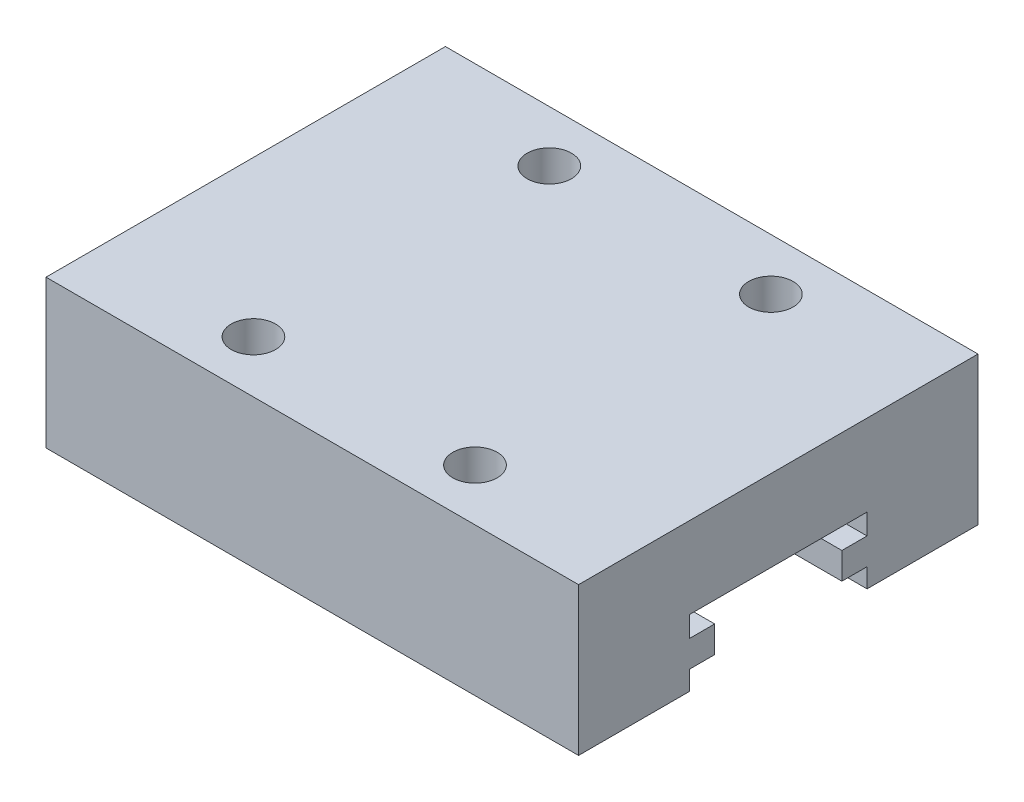
ISO-10303-21;
HEADER;
FILE_DESCRIPTION(('STEP AP214'),'2;1');
FILE_NAME('part.step','',(''),(''),'','','');
FILE_SCHEMA(('AUTOMOTIVE_DESIGN { 1 0 10303 214 1 1 1 1 }'));
ENDSEC;
DATA;
#1=APPLICATION_CONTEXT('core data for automotive mechanical design processes');
#2=APPLICATION_PROTOCOL_DEFINITION('international standard','automotive_design',2000,#1);
#3=PRODUCT_CONTEXT('',#1,'mechanical');
#4=PRODUCT('Part','Part','',(#3));
#5=PRODUCT_RELATED_PRODUCT_CATEGORY('part','',(#4));
#6=PRODUCT_DEFINITION_FORMATION('','',#4);
#7=PRODUCT_DEFINITION_CONTEXT('part definition',#1,'design');
#8=PRODUCT_DEFINITION('design','',#6,#7);
#9=PRODUCT_DEFINITION_SHAPE('','',#8);
#10=(LENGTH_UNIT() NAMED_UNIT(*) SI_UNIT(.MILLI.,.METRE.));
#11=(NAMED_UNIT(*) PLANE_ANGLE_UNIT() SI_UNIT($,.RADIAN.));
#12=(NAMED_UNIT(*) SI_UNIT($,.STERADIAN.) SOLID_ANGLE_UNIT());
#13=UNCERTAINTY_MEASURE_WITH_UNIT(LENGTH_MEASURE(1.E-05),#10,'distance_accuracy_value','');
#14=(GEOMETRIC_REPRESENTATION_CONTEXT(3) GLOBAL_UNCERTAINTY_ASSIGNED_CONTEXT((#13)) GLOBAL_UNIT_ASSIGNED_CONTEXT((#10,
#11,#12)) REPRESENTATION_CONTEXT('',''));
#15=CARTESIAN_POINT('',(0.,0.,0.));
#16=DIRECTION('',(0.,0.,1.));
#17=DIRECTION('',(1.,0.,0.));
#18=AXIS2_PLACEMENT_3D('',#15,#16,#17);
#19=CARTESIAN_POINT('',(0.,0.,0.));
#20=DIRECTION('',(0.,-1.,0.));
#21=DIRECTION('',(0.,0.,-1.));
#22=AXIS2_PLACEMENT_3D('',#19,#20,#21);
#23=PLANE('',#22);
#24=DIRECTION('',(1.,0.,0.));
#25=VECTOR('',#24,1.);
#26=CARTESIAN_POINT('',(-12.8160056179763,0.,-7.5));
#27=LINE('',#26,#25);
#28=CARTESIAN_POINT('',(0.,0.,-7.5));
#29=VERTEX_POINT('',#28);
#30=CARTESIAN_POINT('',(36.,0.,-7.5));
#31=VERTEX_POINT('',#30);
#32=EDGE_CURVE('E183',#29,#31,#27,.T.);
#33=ORIENTED_EDGE('',*,*,#32,.T.);
#34=DIRECTION('',(0.,0.,-1.));
#35=VECTOR('',#34,1.);
#36=CARTESIAN_POINT('',(36.,0.,0.));
#37=LINE('',#36,#35);
#38=CARTESIAN_POINT('',(36.,0.,0.));
#39=VERTEX_POINT('',#38);
#40=EDGE_CURVE('E198',#39,#31,#37,.T.);
#41=ORIENTED_EDGE('',*,*,#40,.F.);
#42=DIRECTION('',(1.,0.,0.));
#43=VECTOR('',#42,1.);
#44=CARTESIAN_POINT('',(0.,0.,0.));
#45=LINE('',#44,#43);
#46=CARTESIAN_POINT('',(0.,0.,0.));
#47=VERTEX_POINT('',#46);
#48=EDGE_CURVE('E214',#47,#39,#45,.T.);
#49=ORIENTED_EDGE('',*,*,#48,.F.);
#50=DIRECTION('',(0.,0.,1.));
#51=VECTOR('',#50,1.);
#52=CARTESIAN_POINT('',(0.,0.,0.));
#53=LINE('',#52,#51);
#54=EDGE_CURVE('E199',#29,#47,#53,.T.);
#55=ORIENTED_EDGE('',*,*,#54,.F.);
#56=EDGE_LOOP('',(#33,#41,#49,#55));
#57=FACE_BOUND('',#56,.T.);
#58=ADVANCED_FACE('F40',(#57),#23,.T.);
#59=CARTESIAN_POINT('',(0.,10.,0.));
#60=DIRECTION('',(1.,0.,0.));
#61=DIRECTION('',(0.,0.,-1.));
#62=AXIS2_PLACEMENT_3D('',#59,#60,#61);
#63=PLANE('',#62);
#64=DIRECTION('',(0.,0.,-1.));
#65=VECTOR('',#64,1.);
#66=CARTESIAN_POINT('',(0.,1.3,-7.5));
#67=LINE('',#66,#65);
#68=CARTESIAN_POINT('',(0.,1.3,-7.5));
#69=VERTEX_POINT('',#68);
#70=CARTESIAN_POINT('',(0.,1.3,-9.2));
#71=VERTEX_POINT('',#70);
#72=EDGE_CURVE('E331',#69,#71,#67,.T.);
#73=ORIENTED_EDGE('',*,*,#72,.F.);
#74=DIRECTION('',(0.,1.,0.));
#75=VECTOR('',#74,1.);
#76=CARTESIAN_POINT('',(0.,0.,-7.5));
#77=LINE('',#76,#75);
#78=EDGE_CURVE('E269',#29,#69,#77,.T.);
#79=ORIENTED_EDGE('',*,*,#78,.F.);
#80=ORIENTED_EDGE('',*,*,#54,.T.);
#81=DIRECTION('',(0.,-1.,0.));
#82=VECTOR('',#81,1.);
#83=CARTESIAN_POINT('',(0.,10.,0.));
#84=LINE('',#83,#82);
#85=CARTESIAN_POINT('',(0.,10.,0.));
#86=VERTEX_POINT('',#85);
#87=EDGE_CURVE('E11',#86,#47,#84,.T.);
#88=ORIENTED_EDGE('',*,*,#87,.F.);
#89=DIRECTION('',(0.,0.,1.));
#90=VECTOR('',#89,1.);
#91=CARTESIAN_POINT('',(0.,10.,0.));
#92=LINE('',#91,#90);
#93=CARTESIAN_POINT('',(0.,10.,-27.));
#94=VERTEX_POINT('',#93);
#95=EDGE_CURVE('E212',#94,#86,#92,.T.);
#96=ORIENTED_EDGE('',*,*,#95,.F.);
#97=DIRECTION('',(0.,-1.,0.));
#98=VECTOR('',#97,1.);
#99=CARTESIAN_POINT('',(0.,10.,-27.));
#100=LINE('',#99,#98);
#101=CARTESIAN_POINT('',(0.,0.,-27.));
#102=VERTEX_POINT('',#101);
#103=EDGE_CURVE('E218',#94,#102,#100,.T.);
#104=ORIENTED_EDGE('',*,*,#103,.T.);
#105=CARTESIAN_POINT('',(0.,0.,-19.5));
#106=VERTEX_POINT('',#105);
#107=EDGE_CURVE('E229',#102,#106,#53,.T.);
#108=ORIENTED_EDGE('',*,*,#107,.T.);
#109=DIRECTION('',(0.,-1.,0.));
#110=VECTOR('',#109,1.);
#111=CARTESIAN_POINT('',(0.,0.,-19.5));
#112=LINE('',#111,#110);
#113=CARTESIAN_POINT('',(0.,1.3,-19.5));
#114=VERTEX_POINT('',#113);
#115=EDGE_CURVE('E59',#114,#106,#112,.T.);
#116=ORIENTED_EDGE('',*,*,#115,.F.);
#117=DIRECTION('',(0.,0.,-1.));
#118=VECTOR('',#117,1.);
#119=CARTESIAN_POINT('',(0.,1.3,-19.5));
#120=LINE('',#119,#118);
#121=CARTESIAN_POINT('',(0.,1.3,-17.8));
#122=VERTEX_POINT('',#121);
#123=EDGE_CURVE('E355',#122,#114,#120,.T.);
#124=ORIENTED_EDGE('',*,*,#123,.F.);
#125=DIRECTION('',(0.,-1.,0.));
#126=VECTOR('',#125,1.);
#127=CARTESIAN_POINT('',(0.,3.1,-17.8));
#128=LINE('',#127,#126);
#129=CARTESIAN_POINT('',(0.,3.1,-17.8));
#130=VERTEX_POINT('',#129);
#131=EDGE_CURVE('E352',#130,#122,#128,.T.);
#132=ORIENTED_EDGE('',*,*,#131,.F.);
#133=DIRECTION('',(0.,0.,1.));
#134=VECTOR('',#133,1.);
#135=CARTESIAN_POINT('',(0.,3.1,-19.5));
#136=LINE('',#135,#134);
#137=CARTESIAN_POINT('',(0.,3.1,-19.5));
#138=VERTEX_POINT('',#137);
#139=EDGE_CURVE('E349',#138,#130,#136,.T.);
#140=ORIENTED_EDGE('',*,*,#139,.F.);
#141=DIRECTION('',(0.,-1.,0.));
#142=VECTOR('',#141,1.);
#143=CARTESIAN_POINT('',(0.,3.1,-19.5));
#144=LINE('',#143,#142);
#145=CARTESIAN_POINT('',(0.,4.5,-19.5));
#146=VERTEX_POINT('',#145);
#147=EDGE_CURVE('E346',#146,#138,#144,.T.);
#148=ORIENTED_EDGE('',*,*,#147,.F.);
#149=DIRECTION('',(0.,0.,-1.));
#150=VECTOR('',#149,1.);
#151=CARTESIAN_POINT('',(0.,4.5,-7.5));
#152=LINE('',#151,#150);
#153=CARTESIAN_POINT('',(0.,4.5,-7.5));
#154=VERTEX_POINT('',#153);
#155=EDGE_CURVE('E343',#154,#146,#152,.T.);
#156=ORIENTED_EDGE('',*,*,#155,.F.);
#157=DIRECTION('',(0.,1.,0.));
#158=VECTOR('',#157,1.);
#159=CARTESIAN_POINT('',(0.,3.1,-7.5));
#160=LINE('',#159,#158);
#161=CARTESIAN_POINT('',(0.,3.1,-7.5));
#162=VERTEX_POINT('',#161);
#163=EDGE_CURVE('E340',#162,#154,#160,.T.);
#164=ORIENTED_EDGE('',*,*,#163,.F.);
#165=DIRECTION('',(0.,0.,1.));
#166=VECTOR('',#165,1.);
#167=CARTESIAN_POINT('',(0.,3.1,-7.5));
#168=LINE('',#167,#166);
#169=CARTESIAN_POINT('',(0.,3.1,-9.2));
#170=VERTEX_POINT('',#169);
#171=EDGE_CURVE('E337',#170,#162,#168,.T.);
#172=ORIENTED_EDGE('',*,*,#171,.F.);
#173=DIRECTION('',(0.,1.,0.));
#174=VECTOR('',#173,1.);
#175=CARTESIAN_POINT('',(0.,3.1,-9.2));
#176=LINE('',#175,#174);
#177=EDGE_CURVE('E334',#71,#170,#176,.T.);
#178=ORIENTED_EDGE('',*,*,#177,.F.);
#179=EDGE_LOOP('',(#73,#79,#80,#88,#96,#104,#108,#116,#124,#132,#140,#148,#156,#164,#172,#178));
#180=FACE_BOUND('',#179,.T.);
#181=ADVANCED_FACE('F42',(#180),#63,.F.);
#182=CARTESIAN_POINT('',(0.,10.,0.));
#183=DIRECTION('',(0.,0.,-1.));
#184=DIRECTION('',(-1.,0.,0.));
#185=AXIS2_PLACEMENT_3D('',#182,#183,#184);
#186=PLANE('',#185);
#187=ORIENTED_EDGE('',*,*,#48,.T.);
#188=DIRECTION('',(0.,-1.,0.));
#189=VECTOR('',#188,1.);
#190=CARTESIAN_POINT('',(36.,10.,0.));
#191=LINE('',#190,#189);
#192=CARTESIAN_POINT('',(36.,10.,0.));
#193=VERTEX_POINT('',#192);
#194=EDGE_CURVE('E49',#193,#39,#191,.T.);
#195=ORIENTED_EDGE('',*,*,#194,.F.);
#196=DIRECTION('',(1.,0.,0.));
#197=VECTOR('',#196,1.);
#198=CARTESIAN_POINT('',(0.,10.,0.));
#199=LINE('',#198,#197);
#200=EDGE_CURVE('E104',#86,#193,#199,.T.);
#201=ORIENTED_EDGE('',*,*,#200,.F.);
#202=ORIENTED_EDGE('',*,*,#87,.T.);
#203=EDGE_LOOP('',(#187,#195,#201,#202));
#204=FACE_BOUND('',#203,.T.);
#205=ADVANCED_FACE('F370',(#204),#186,.F.);
#206=CARTESIAN_POINT('',(36.,10.,0.));
#207=DIRECTION('',(-1.,0.,0.));
#208=DIRECTION('',(0.,0.,1.));
#209=AXIS2_PLACEMENT_3D('',#206,#207,#208);
#210=PLANE('',#209);
#211=ORIENTED_EDGE('',*,*,#40,.T.);
#212=DIRECTION('',(0.,-1.,0.));
#213=VECTOR('',#212,1.);
#214=CARTESIAN_POINT('',(36.,0.,-7.5));
#215=LINE('',#214,#213);
#216=CARTESIAN_POINT('',(36.,1.3,-7.5));
#217=VERTEX_POINT('',#216);
#218=EDGE_CURVE('E180',#217,#31,#215,.T.);
#219=ORIENTED_EDGE('',*,*,#218,.F.);
#220=DIRECTION('',(0.,0.,1.));
#221=VECTOR('',#220,1.);
#222=CARTESIAN_POINT('',(36.,1.3,-7.5));
#223=LINE('',#222,#221);
#224=CARTESIAN_POINT('',(36.,1.3,-9.2));
#225=VERTEX_POINT('',#224);
#226=EDGE_CURVE('E202',#225,#217,#223,.T.);
#227=ORIENTED_EDGE('',*,*,#226,.F.);
#228=DIRECTION('',(0.,-1.,0.));
#229=VECTOR('',#228,1.);
#230=CARTESIAN_POINT('',(36.,3.1,-9.2));
#231=LINE('',#230,#229);
#232=CARTESIAN_POINT('',(36.,3.1,-9.2));
#233=VERTEX_POINT('',#232);
#234=EDGE_CURVE('E303',#233,#225,#231,.T.);
#235=ORIENTED_EDGE('',*,*,#234,.F.);
#236=DIRECTION('',(0.,0.,-1.));
#237=VECTOR('',#236,1.);
#238=CARTESIAN_POINT('',(36.,3.1,-7.5));
#239=LINE('',#238,#237);
#240=CARTESIAN_POINT('',(36.,3.1,-7.5));
#241=VERTEX_POINT('',#240);
#242=EDGE_CURVE('E306',#241,#233,#239,.T.);
#243=ORIENTED_EDGE('',*,*,#242,.F.);
#244=DIRECTION('',(0.,-1.,0.));
#245=VECTOR('',#244,1.);
#246=CARTESIAN_POINT('',(36.,3.1,-7.5));
#247=LINE('',#246,#245);
#248=CARTESIAN_POINT('',(36.,4.5,-7.5));
#249=VERTEX_POINT('',#248);
#250=EDGE_CURVE('E309',#249,#241,#247,.T.);
#251=ORIENTED_EDGE('',*,*,#250,.F.);
#252=DIRECTION('',(0.,0.,1.));
#253=VECTOR('',#252,1.);
#254=CARTESIAN_POINT('',(36.,4.5,-7.5));
#255=LINE('',#254,#253);
#256=CARTESIAN_POINT('',(36.,4.5,-19.5));
#257=VERTEX_POINT('',#256);
#258=EDGE_CURVE('E312',#257,#249,#255,.T.);
#259=ORIENTED_EDGE('',*,*,#258,.F.);
#260=DIRECTION('',(0.,1.,0.));
#261=VECTOR('',#260,1.);
#262=CARTESIAN_POINT('',(36.,3.1,-19.5));
#263=LINE('',#262,#261);
#264=CARTESIAN_POINT('',(36.,3.1,-19.5));
#265=VERTEX_POINT('',#264);
#266=EDGE_CURVE('E315',#265,#257,#263,.T.);
#267=ORIENTED_EDGE('',*,*,#266,.F.);
#268=DIRECTION('',(0.,0.,-1.));
#269=VECTOR('',#268,1.);
#270=CARTESIAN_POINT('',(36.,3.1,-19.5));
#271=LINE('',#270,#269);
#272=CARTESIAN_POINT('',(36.,3.1,-17.8));
#273=VERTEX_POINT('',#272);
#274=EDGE_CURVE('E318',#273,#265,#271,.T.);
#275=ORIENTED_EDGE('',*,*,#274,.F.);
#276=DIRECTION('',(0.,1.,0.));
#277=VECTOR('',#276,1.);
#278=CARTESIAN_POINT('',(36.,3.1,-17.8));
#279=LINE('',#278,#277);
#280=CARTESIAN_POINT('',(36.,1.3,-17.8));
#281=VERTEX_POINT('',#280);
#282=EDGE_CURVE('E321',#281,#273,#279,.T.);
#283=ORIENTED_EDGE('',*,*,#282,.F.);
#284=DIRECTION('',(0.,0.,1.));
#285=VECTOR('',#284,1.);
#286=CARTESIAN_POINT('',(36.,1.3,-19.5));
#287=LINE('',#286,#285);
#288=CARTESIAN_POINT('',(36.,1.3,-19.5));
#289=VERTEX_POINT('',#288);
#290=EDGE_CURVE('E324',#289,#281,#287,.T.);
#291=ORIENTED_EDGE('',*,*,#290,.F.);
#292=DIRECTION('',(0.,1.,0.));
#293=VECTOR('',#292,1.);
#294=CARTESIAN_POINT('',(36.,0.,-19.5));
#295=LINE('',#294,#293);
#296=CARTESIAN_POINT('',(36.,0.,-19.5));
#297=VERTEX_POINT('',#296);
#298=EDGE_CURVE('E192',#297,#289,#295,.T.);
#299=ORIENTED_EDGE('',*,*,#298,.F.);
#300=CARTESIAN_POINT('',(36.,0.,-27.));
#301=VERTEX_POINT('',#300);
#302=EDGE_CURVE('E208',#297,#301,#37,.T.);
#303=ORIENTED_EDGE('',*,*,#302,.T.);
#304=DIRECTION('',(0.,-1.,0.));
#305=VECTOR('',#304,1.);
#306=CARTESIAN_POINT('',(36.,10.,-27.));
#307=LINE('',#306,#305);
#308=CARTESIAN_POINT('',(36.,10.,-27.));
#309=VERTEX_POINT('',#308);
#310=EDGE_CURVE('E221',#309,#301,#307,.T.);
#311=ORIENTED_EDGE('',*,*,#310,.F.);
#312=DIRECTION('',(0.,0.,-1.));
#313=VECTOR('',#312,1.);
#314=CARTESIAN_POINT('',(36.,10.,0.));
#315=LINE('',#314,#313);
#316=EDGE_CURVE('E238',#193,#309,#315,.T.);
#317=ORIENTED_EDGE('',*,*,#316,.F.);
#318=ORIENTED_EDGE('',*,*,#194,.T.);
#319=EDGE_LOOP('',(#211,#219,#227,#235,#243,#251,#259,#267,#275,#283,#291,#299,#303,#311,#317,#318));
#320=FACE_BOUND('',#319,.T.);
#321=ADVANCED_FACE('F205',(#320),#210,.F.);
#322=CARTESIAN_POINT('',(0.,10.,-27.));
#323=DIRECTION('',(0.,0.,1.));
#324=DIRECTION('',(1.,0.,0.));
#325=AXIS2_PLACEMENT_3D('',#322,#323,#324);
#326=PLANE('',#325);
#327=DIRECTION('',(-1.,0.,0.));
#328=VECTOR('',#327,1.);
#329=CARTESIAN_POINT('',(0.,0.,-27.));
#330=LINE('',#329,#328);
#331=EDGE_CURVE('E94',#301,#102,#330,.T.);
#332=ORIENTED_EDGE('',*,*,#331,.T.);
#333=ORIENTED_EDGE('',*,*,#103,.F.);
#334=DIRECTION('',(-1.,0.,0.));
#335=VECTOR('',#334,1.);
#336=CARTESIAN_POINT('',(0.,10.,-27.));
#337=LINE('',#336,#335);
#338=EDGE_CURVE('E71',#309,#94,#337,.T.);
#339=ORIENTED_EDGE('',*,*,#338,.F.);
#340=ORIENTED_EDGE('',*,*,#310,.T.);
#341=EDGE_LOOP('',(#332,#333,#339,#340));
#342=FACE_BOUND('',#341,.T.);
#343=ADVANCED_FACE('F223',(#342),#326,.F.);
#344=CARTESIAN_POINT('',(0.,10.,0.));
#345=DIRECTION('',(0.,-1.,0.));
#346=DIRECTION('',(0.,0.,-1.));
#347=AXIS2_PLACEMENT_3D('',#344,#345,#346);
#348=PLANE('',#347);
#349=CARTESIAN_POINT('',(25.4999864669187,10.,-23.5));
#350=DIRECTION('',(0.,1.,0.));
#351=DIRECTION('',(0.,0.,1.));
#352=AXIS2_PLACEMENT_3D('',#349,#350,#351);
#353=CIRCLE('',#352,1.5);
#354=CARTESIAN_POINT('',(25.4999864669187,10.,-22.));
#355=VERTEX_POINT('',#354);
#356=EDGE_CURVE('E261',#355,#355,#353,.T.);
#357=ORIENTED_EDGE('',*,*,#356,.F.);
#358=EDGE_LOOP('',(#357));
#359=FACE_BOUND('',#358,.T.);
#360=CARTESIAN_POINT('',(10.5,10.,-3.52014924954561));
#361=DIRECTION('',(0.,1.,0.));
#362=DIRECTION('',(0.,0.,1.));
#363=AXIS2_PLACEMENT_3D('',#360,#361,#362);
#364=CIRCLE('',#363,1.5);
#365=CARTESIAN_POINT('',(10.5,10.,-2.02014924954561));
#366=VERTEX_POINT('',#365);
#367=EDGE_CURVE('E252',#366,#366,#364,.T.);
#368=ORIENTED_EDGE('',*,*,#367,.F.);
#369=EDGE_LOOP('',(#368));
#370=FACE_BOUND('',#369,.T.);
#371=CARTESIAN_POINT('',(25.4999864669187,10.,-3.5));
#372=DIRECTION('',(0.,1.,0.));
#373=DIRECTION('',(0.,0.,1.));
#374=AXIS2_PLACEMENT_3D('',#371,#372,#373);
#375=CIRCLE('',#374,1.5);
#376=CARTESIAN_POINT('',(25.4999864669187,10.,-2.));
#377=VERTEX_POINT('',#376);
#378=EDGE_CURVE('E266',#377,#377,#375,.T.);
#379=ORIENTED_EDGE('',*,*,#378,.F.);
#380=EDGE_LOOP('',(#379));
#381=FACE_BOUND('',#380,.T.);
#382=CARTESIAN_POINT('',(10.5,10.,-23.5201492495456));
#383=DIRECTION('',(0.,1.,0.));
#384=DIRECTION('',(0.,0.,1.));
#385=AXIS2_PLACEMENT_3D('',#382,#383,#384);
#386=CIRCLE('',#385,1.5);
#387=CARTESIAN_POINT('',(10.5,10.,-22.0201492495456));
#388=VERTEX_POINT('',#387);
#389=EDGE_CURVE('E244',#388,#388,#386,.T.);
#390=ORIENTED_EDGE('',*,*,#389,.F.);
#391=EDGE_LOOP('',(#390));
#392=FACE_BOUND('',#391,.T.);
#393=ORIENTED_EDGE('',*,*,#95,.T.);
#394=ORIENTED_EDGE('',*,*,#200,.T.);
#395=ORIENTED_EDGE('',*,*,#316,.T.);
#396=ORIENTED_EDGE('',*,*,#338,.T.);
#397=EDGE_LOOP('',(#393,#394,#395,#396));
#398=FACE_BOUND('',#397,.T.);
#399=ADVANCED_FACE('F382',(#359,#370,#381,#392,#398),#348,.F.);
#400=DIRECTION('',(1.,0.,0.));
#401=VECTOR('',#400,1.);
#402=CARTESIAN_POINT('',(-12.8160056179763,0.,-19.5));
#403=LINE('',#402,#401);
#404=EDGE_CURVE('E201',#106,#297,#403,.T.);
#405=ORIENTED_EDGE('',*,*,#404,.F.);
#406=ORIENTED_EDGE('',*,*,#107,.F.);
#407=ORIENTED_EDGE('',*,*,#331,.F.);
#408=ORIENTED_EDGE('',*,*,#302,.F.);
#409=EDGE_LOOP('',(#405,#406,#407,#408));
#410=FACE_BOUND('',#409,.T.);
#411=ADVANCED_FACE('F227',(#410),#23,.T.);
#412=CARTESIAN_POINT('',(10.5,5.,-23.5201492495456));
#413=DIRECTION('',(0.,1.,0.));
#414=DIRECTION('',(0.,0.,1.));
#415=AXIS2_PLACEMENT_3D('',#412,#413,#414);
#416=CYLINDRICAL_SURFACE('',#415,1.5);
#417=CARTESIAN_POINT('',(10.5,5.,-23.5201492495456));
#418=DIRECTION('',(0.,1.,0.));
#419=DIRECTION('',(0.,0.,1.));
#420=AXIS2_PLACEMENT_3D('',#417,#418,#419);
#421=CIRCLE('',#420,1.5);
#422=CARTESIAN_POINT('',(10.5,5.,-22.0201492495456));
#423=VERTEX_POINT('',#422);
#424=EDGE_CURVE('E234',#423,#423,#421,.T.);
#425=ORIENTED_EDGE('',*,*,#424,.F.);
#426=EDGE_LOOP('',(#425));
#427=FACE_BOUND('',#426,.T.);
#428=ORIENTED_EDGE('',*,*,#389,.T.);
#429=EDGE_LOOP('',(#428));
#430=FACE_BOUND('',#429,.T.);
#431=ADVANCED_FACE('F381',(#427,#430),#416,.F.);
#432=CARTESIAN_POINT('',(10.5,5.,-23.5201492495456));
#433=DIRECTION('',(0.,1.,0.));
#434=DIRECTION('',(0.,0.,1.));
#435=AXIS2_PLACEMENT_3D('',#432,#433,#434);
#436=PLANE('',#435);
#437=ORIENTED_EDGE('',*,*,#424,.T.);
#438=EDGE_LOOP('',(#437));
#439=FACE_BOUND('',#438,.T.);
#440=ADVANCED_FACE('F387',(#439),#436,.T.);
#441=CARTESIAN_POINT('',(25.4999864669187,5.,-3.5));
#442=DIRECTION('',(0.,1.,0.));
#443=DIRECTION('',(0.,0.,1.));
#444=AXIS2_PLACEMENT_3D('',#441,#442,#443);
#445=CYLINDRICAL_SURFACE('',#444,1.5);
#446=CARTESIAN_POINT('',(25.4999864669187,5.,-3.5));
#447=DIRECTION('',(0.,1.,0.));
#448=DIRECTION('',(0.,0.,1.));
#449=AXIS2_PLACEMENT_3D('',#446,#447,#448);
#450=CIRCLE('',#449,1.5);
#451=CARTESIAN_POINT('',(25.4999864669187,5.,-2.));
#452=VERTEX_POINT('',#451);
#453=EDGE_CURVE('E257',#452,#452,#450,.T.);
#454=ORIENTED_EDGE('',*,*,#453,.F.);
#455=EDGE_LOOP('',(#454));
#456=FACE_BOUND('',#455,.T.);
#457=ORIENTED_EDGE('',*,*,#378,.T.);
#458=EDGE_LOOP('',(#457));
#459=FACE_BOUND('',#458,.T.);
#460=ADVANCED_FACE('F399',(#456,#459),#445,.F.);
#461=CARTESIAN_POINT('',(25.4999864669187,5.,-3.5));
#462=DIRECTION('',(0.,1.,0.));
#463=DIRECTION('',(0.,0.,1.));
#464=AXIS2_PLACEMENT_3D('',#461,#462,#463);
#465=PLANE('',#464);
#466=ORIENTED_EDGE('',*,*,#453,.T.);
#467=EDGE_LOOP('',(#466));
#468=FACE_BOUND('',#467,.T.);
#469=ADVANCED_FACE('F405',(#468),#465,.T.);
#470=CARTESIAN_POINT('',(10.5,5.,-3.52014924954561));
#471=DIRECTION('',(0.,1.,0.));
#472=DIRECTION('',(0.,0.,1.));
#473=AXIS2_PLACEMENT_3D('',#470,#471,#472);
#474=CYLINDRICAL_SURFACE('',#473,1.5);
#475=CARTESIAN_POINT('',(10.5,5.,-3.52014924954561));
#476=DIRECTION('',(0.,1.,0.));
#477=DIRECTION('',(0.,0.,1.));
#478=AXIS2_PLACEMENT_3D('',#475,#476,#477);
#479=CIRCLE('',#478,1.5);
#480=CARTESIAN_POINT('',(10.5,5.,-2.02014924954561));
#481=VERTEX_POINT('',#480);
#482=EDGE_CURVE('E256',#481,#481,#479,.T.);
#483=ORIENTED_EDGE('',*,*,#482,.F.);
#484=EDGE_LOOP('',(#483));
#485=FACE_BOUND('',#484,.T.);
#486=ORIENTED_EDGE('',*,*,#367,.T.);
#487=EDGE_LOOP('',(#486));
#488=FACE_BOUND('',#487,.T.);
#489=ADVANCED_FACE('F401',(#485,#488),#474,.F.);
#490=CARTESIAN_POINT('',(10.5,5.,-3.52014924954561));
#491=DIRECTION('',(0.,1.,0.));
#492=DIRECTION('',(0.,0.,1.));
#493=AXIS2_PLACEMENT_3D('',#490,#491,#492);
#494=PLANE('',#493);
#495=ORIENTED_EDGE('',*,*,#482,.T.);
#496=EDGE_LOOP('',(#495));
#497=FACE_BOUND('',#496,.T.);
#498=ADVANCED_FACE('F404',(#497),#494,.T.);
#499=CARTESIAN_POINT('',(25.4999864669187,5.,-23.5));
#500=DIRECTION('',(0.,1.,0.));
#501=DIRECTION('',(0.,0.,1.));
#502=AXIS2_PLACEMENT_3D('',#499,#500,#501);
#503=CYLINDRICAL_SURFACE('',#502,1.5);
#504=CARTESIAN_POINT('',(25.4999864669187,5.,-23.5));
#505=DIRECTION('',(0.,1.,0.));
#506=DIRECTION('',(0.,0.,1.));
#507=AXIS2_PLACEMENT_3D('',#504,#505,#506);
#508=CIRCLE('',#507,1.5);
#509=CARTESIAN_POINT('',(25.4999864669187,5.,-22.));
#510=VERTEX_POINT('',#509);
#511=EDGE_CURVE('E248',#510,#510,#508,.T.);
#512=ORIENTED_EDGE('',*,*,#511,.F.);
#513=EDGE_LOOP('',(#512));
#514=FACE_BOUND('',#513,.T.);
#515=ORIENTED_EDGE('',*,*,#356,.T.);
#516=EDGE_LOOP('',(#515));
#517=FACE_BOUND('',#516,.T.);
#518=ADVANCED_FACE('F409',(#514,#517),#503,.F.);
#519=CARTESIAN_POINT('',(25.4999864669187,5.,-23.5));
#520=DIRECTION('',(0.,1.,0.));
#521=DIRECTION('',(0.,0.,1.));
#522=AXIS2_PLACEMENT_3D('',#519,#520,#521);
#523=PLANE('',#522);
#524=ORIENTED_EDGE('',*,*,#511,.T.);
#525=EDGE_LOOP('',(#524));
#526=FACE_BOUND('',#525,.T.);
#527=ADVANCED_FACE('F413',(#526),#523,.T.);
#528=CARTESIAN_POINT('',(-12.8160056179763,0.,-7.5));
#529=DIRECTION('',(0.,0.,1.));
#530=DIRECTION('',(0.,-1.,0.));
#531=AXIS2_PLACEMENT_3D('',#528,#529,#530);
#532=PLANE('',#531);
#533=ORIENTED_EDGE('',*,*,#78,.T.);
#534=DIRECTION('',(1.,0.,0.));
#535=VECTOR('',#534,1.);
#536=CARTESIAN_POINT('',(-12.8160056179763,1.3,-7.5));
#537=LINE('',#536,#535);
#538=EDGE_CURVE('E186',#69,#217,#537,.T.);
#539=ORIENTED_EDGE('',*,*,#538,.T.);
#540=ORIENTED_EDGE('',*,*,#218,.T.);
#541=ORIENTED_EDGE('',*,*,#32,.F.);
#542=EDGE_LOOP('',(#533,#539,#540,#541));
#543=FACE_BOUND('',#542,.T.);
#544=ADVANCED_FACE('F182',(#543),#532,.F.);
#545=CARTESIAN_POINT('',(-12.8160056179763,1.3,-7.5));
#546=DIRECTION('',(0.,1.,0.));
#547=DIRECTION('',(0.,0.,1.));
#548=AXIS2_PLACEMENT_3D('',#545,#546,#547);
#549=PLANE('',#548);
#550=ORIENTED_EDGE('',*,*,#72,.T.);
#551=DIRECTION('',(1.,0.,0.));
#552=VECTOR('',#551,1.);
#553=CARTESIAN_POINT('',(-12.8160056179763,1.3,-9.2));
#554=LINE('',#553,#552);
#555=EDGE_CURVE('E297',#71,#225,#554,.T.);
#556=ORIENTED_EDGE('',*,*,#555,.T.);
#557=ORIENTED_EDGE('',*,*,#226,.T.);
#558=ORIENTED_EDGE('',*,*,#538,.F.);
#559=EDGE_LOOP('',(#550,#556,#557,#558));
#560=FACE_BOUND('',#559,.T.);
#561=ADVANCED_FACE('F426',(#560),#549,.F.);
#562=CARTESIAN_POINT('',(-12.8160056179763,3.1,-9.2));
#563=DIRECTION('',(0.,0.,1.));
#564=DIRECTION('',(0.,-1.,0.));
#565=AXIS2_PLACEMENT_3D('',#562,#563,#564);
#566=PLANE('',#565);
#567=ORIENTED_EDGE('',*,*,#177,.T.);
#568=DIRECTION('',(1.,0.,0.));
#569=VECTOR('',#568,1.);
#570=CARTESIAN_POINT('',(-12.8160056179763,3.1,-9.2));
#571=LINE('',#570,#569);
#572=EDGE_CURVE('E294',#170,#233,#571,.T.);
#573=ORIENTED_EDGE('',*,*,#572,.T.);
#574=ORIENTED_EDGE('',*,*,#234,.T.);
#575=ORIENTED_EDGE('',*,*,#555,.F.);
#576=EDGE_LOOP('',(#567,#573,#574,#575));
#577=FACE_BOUND('',#576,.T.);
#578=ADVANCED_FACE('F454',(#577),#566,.F.);
#579=CARTESIAN_POINT('',(-12.8160056179763,3.1,-7.5));
#580=DIRECTION('',(0.,-1.,0.));
#581=DIRECTION('',(0.,0.,-1.));
#582=AXIS2_PLACEMENT_3D('',#579,#580,#581);
#583=PLANE('',#582);
#584=ORIENTED_EDGE('',*,*,#171,.T.);
#585=DIRECTION('',(1.,0.,0.));
#586=VECTOR('',#585,1.);
#587=CARTESIAN_POINT('',(-12.8160056179763,3.1,-7.5));
#588=LINE('',#587,#586);
#589=EDGE_CURVE('E291',#162,#241,#588,.T.);
#590=ORIENTED_EDGE('',*,*,#589,.T.);
#591=ORIENTED_EDGE('',*,*,#242,.T.);
#592=ORIENTED_EDGE('',*,*,#572,.F.);
#593=EDGE_LOOP('',(#584,#590,#591,#592));
#594=FACE_BOUND('',#593,.T.);
#595=ADVANCED_FACE('F450',(#594),#583,.F.);
#596=CARTESIAN_POINT('',(-12.8160056179763,3.1,-7.5));
#597=DIRECTION('',(0.,0.,1.));
#598=DIRECTION('',(0.,-1.,0.));
#599=AXIS2_PLACEMENT_3D('',#596,#597,#598);
#600=PLANE('',#599);
#601=ORIENTED_EDGE('',*,*,#163,.T.);
#602=DIRECTION('',(1.,0.,0.));
#603=VECTOR('',#602,1.);
#604=CARTESIAN_POINT('',(-12.8160056179763,4.5,-7.5));
#605=LINE('',#604,#603);
#606=EDGE_CURVE('E288',#154,#249,#605,.T.);
#607=ORIENTED_EDGE('',*,*,#606,.T.);
#608=ORIENTED_EDGE('',*,*,#250,.T.);
#609=ORIENTED_EDGE('',*,*,#589,.F.);
#610=EDGE_LOOP('',(#601,#607,#608,#609));
#611=FACE_BOUND('',#610,.T.);
#612=ADVANCED_FACE('F446',(#611),#600,.F.);
#613=CARTESIAN_POINT('',(-12.8160056179763,4.5,-7.5));
#614=DIRECTION('',(0.,1.,0.));
#615=DIRECTION('',(0.,0.,1.));
#616=AXIS2_PLACEMENT_3D('',#613,#614,#615);
#617=PLANE('',#616);
#618=ORIENTED_EDGE('',*,*,#155,.T.);
#619=DIRECTION('',(1.,0.,0.));
#620=VECTOR('',#619,1.);
#621=CARTESIAN_POINT('',(-12.8160056179763,4.5,-19.5));
#622=LINE('',#621,#620);
#623=EDGE_CURVE('E286',#146,#257,#622,.T.);
#624=ORIENTED_EDGE('',*,*,#623,.T.);
#625=ORIENTED_EDGE('',*,*,#258,.T.);
#626=ORIENTED_EDGE('',*,*,#606,.F.);
#627=EDGE_LOOP('',(#618,#624,#625,#626));
#628=FACE_BOUND('',#627,.T.);
#629=ADVANCED_FACE('F442',(#628),#617,.F.);
#630=CARTESIAN_POINT('',(-12.8160056179763,3.1,-19.5));
#631=DIRECTION('',(0.,0.,-1.));
#632=DIRECTION('',(0.,1.,0.));
#633=AXIS2_PLACEMENT_3D('',#630,#631,#632);
#634=PLANE('',#633);
#635=ORIENTED_EDGE('',*,*,#147,.T.);
#636=DIRECTION('',(1.,0.,0.));
#637=VECTOR('',#636,1.);
#638=CARTESIAN_POINT('',(-12.8160056179763,3.1,-19.5));
#639=LINE('',#638,#637);
#640=EDGE_CURVE('E283',#138,#265,#639,.T.);
#641=ORIENTED_EDGE('',*,*,#640,.T.);
#642=ORIENTED_EDGE('',*,*,#266,.T.);
#643=ORIENTED_EDGE('',*,*,#623,.F.);
#644=EDGE_LOOP('',(#635,#641,#642,#643));
#645=FACE_BOUND('',#644,.T.);
#646=ADVANCED_FACE('F438',(#645),#634,.F.);
#647=CARTESIAN_POINT('',(-12.8160056179763,3.1,-19.5));
#648=DIRECTION('',(0.,-1.,0.));
#649=DIRECTION('',(0.,0.,-1.));
#650=AXIS2_PLACEMENT_3D('',#647,#648,#649);
#651=PLANE('',#650);
#652=ORIENTED_EDGE('',*,*,#139,.T.);
#653=DIRECTION('',(1.,0.,0.));
#654=VECTOR('',#653,1.);
#655=CARTESIAN_POINT('',(-12.8160056179763,3.1,-17.8));
#656=LINE('',#655,#654);
#657=EDGE_CURVE('E280',#130,#273,#656,.T.);
#658=ORIENTED_EDGE('',*,*,#657,.T.);
#659=ORIENTED_EDGE('',*,*,#274,.T.);
#660=ORIENTED_EDGE('',*,*,#640,.F.);
#661=EDGE_LOOP('',(#652,#658,#659,#660));
#662=FACE_BOUND('',#661,.T.);
#663=ADVANCED_FACE('F434',(#662),#651,.F.);
#664=CARTESIAN_POINT('',(-12.8160056179763,3.1,-17.8));
#665=DIRECTION('',(0.,0.,-1.));
#666=DIRECTION('',(0.,1.,0.));
#667=AXIS2_PLACEMENT_3D('',#664,#665,#666);
#668=PLANE('',#667);
#669=ORIENTED_EDGE('',*,*,#131,.T.);
#670=DIRECTION('',(1.,0.,0.));
#671=VECTOR('',#670,1.);
#672=CARTESIAN_POINT('',(-12.8160056179763,1.3,-17.8));
#673=LINE('',#672,#671);
#674=EDGE_CURVE('E277',#122,#281,#673,.T.);
#675=ORIENTED_EDGE('',*,*,#674,.T.);
#676=ORIENTED_EDGE('',*,*,#282,.T.);
#677=ORIENTED_EDGE('',*,*,#657,.F.);
#678=EDGE_LOOP('',(#669,#675,#676,#677));
#679=FACE_BOUND('',#678,.T.);
#680=ADVANCED_FACE('F431',(#679),#668,.F.);
#681=CARTESIAN_POINT('',(-12.8160056179763,1.3,-19.5));
#682=DIRECTION('',(0.,1.,0.));
#683=DIRECTION('',(0.,0.,1.));
#684=AXIS2_PLACEMENT_3D('',#681,#682,#683);
#685=PLANE('',#684);
#686=ORIENTED_EDGE('',*,*,#123,.T.);
#687=DIRECTION('',(1.,0.,0.));
#688=VECTOR('',#687,1.);
#689=CARTESIAN_POINT('',(-12.8160056179763,1.3,-19.5));
#690=LINE('',#689,#688);
#691=EDGE_CURVE('E274',#114,#289,#690,.T.);
#692=ORIENTED_EDGE('',*,*,#691,.T.);
#693=ORIENTED_EDGE('',*,*,#290,.T.);
#694=ORIENTED_EDGE('',*,*,#674,.F.);
#695=EDGE_LOOP('',(#686,#692,#693,#694));
#696=FACE_BOUND('',#695,.T.);
#697=ADVANCED_FACE('F362',(#696),#685,.F.);
#698=CARTESIAN_POINT('',(-12.8160056179763,0.,-19.5));
#699=DIRECTION('',(0.,0.,-1.));
#700=DIRECTION('',(0.,1.,0.));
#701=AXIS2_PLACEMENT_3D('',#698,#699,#700);
#702=PLANE('',#701);
#703=ORIENTED_EDGE('',*,*,#115,.T.);
#704=ORIENTED_EDGE('',*,*,#404,.T.);
#705=ORIENTED_EDGE('',*,*,#298,.T.);
#706=ORIENTED_EDGE('',*,*,#691,.F.);
#707=EDGE_LOOP('',(#703,#704,#705,#706));
#708=FACE_BOUND('',#707,.T.);
#709=ADVANCED_FACE('F364',(#708),#702,.F.);
#710=CLOSED_SHELL('',(#58,#181,#205,#321,#343,#399,#411,#431,#440,#460,#469,#489,#498,#518,#527,
#544,#561,#578,#595,#612,#629,#646,#663,#680,#697,#709));
#711=MANIFOLD_SOLID_BREP('B2',#710);
#712=ADVANCED_BREP_SHAPE_REPRESENTATION('',(#18,#711),#14);
#713=SHAPE_DEFINITION_REPRESENTATION(#9,#712);
ENDSEC;
END-ISO-10303-21;
